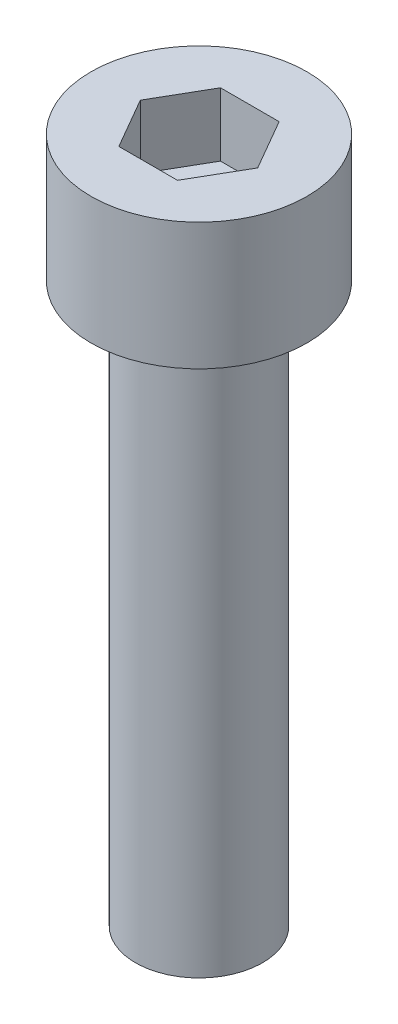
ISO-10303-21;
HEADER;
FILE_DESCRIPTION(('STEP AP214'),'2;1');
FILE_NAME('part.step','',(''),(''),'','','');
FILE_SCHEMA(('AUTOMOTIVE_DESIGN { 1 0 10303 214 1 1 1 1 }'));
ENDSEC;
DATA;
#1=APPLICATION_CONTEXT('core data for automotive mechanical design processes');
#2=APPLICATION_PROTOCOL_DEFINITION('international standard','automotive_design',2000,#1);
#3=PRODUCT_CONTEXT('',#1,'mechanical');
#4=PRODUCT('Part','Part','',(#3));
#5=PRODUCT_RELATED_PRODUCT_CATEGORY('part','',(#4));
#6=PRODUCT_DEFINITION_FORMATION('','',#4);
#7=PRODUCT_DEFINITION_CONTEXT('part definition',#1,'design');
#8=PRODUCT_DEFINITION('design','',#6,#7);
#9=PRODUCT_DEFINITION_SHAPE('','',#8);
#10=(LENGTH_UNIT() NAMED_UNIT(*) SI_UNIT(.MILLI.,.METRE.));
#11=(NAMED_UNIT(*) PLANE_ANGLE_UNIT() SI_UNIT($,.RADIAN.));
#12=(NAMED_UNIT(*) SI_UNIT($,.STERADIAN.) SOLID_ANGLE_UNIT());
#13=UNCERTAINTY_MEASURE_WITH_UNIT(LENGTH_MEASURE(1.E-05),#10,'distance_accuracy_value','');
#14=(GEOMETRIC_REPRESENTATION_CONTEXT(3) GLOBAL_UNCERTAINTY_ASSIGNED_CONTEXT((#13)) GLOBAL_UNIT_ASSIGNED_CONTEXT((#10,
#11,#12)) REPRESENTATION_CONTEXT('',''));
#15=CARTESIAN_POINT('',(0.,0.,0.));
#16=DIRECTION('',(0.,0.,1.));
#17=DIRECTION('',(1.,0.,0.));
#18=AXIS2_PLACEMENT_3D('',#15,#16,#17);
#19=CARTESIAN_POINT('',(0.,5.,0.));
#20=DIRECTION('',(0.,-1.,0.));
#21=DIRECTION('',(0.,0.,-1.));
#22=AXIS2_PLACEMENT_3D('',#19,#20,#21);
#23=CYLINDRICAL_SURFACE('',#22,4.25);
#24=CARTESIAN_POINT('',(0.,5.,0.));
#25=DIRECTION('',(0.,1.,0.));
#26=DIRECTION('',(0.,0.,1.));
#27=AXIS2_PLACEMENT_3D('',#24,#25,#26);
#28=CIRCLE('',#27,4.25);
#29=CARTESIAN_POINT('',(0.,5.,4.25));
#30=VERTEX_POINT('',#29);
#31=EDGE_CURVE('E43',#30,#30,#28,.T.);
#32=ORIENTED_EDGE('',*,*,#31,.F.);
#33=EDGE_LOOP('',(#32));
#34=FACE_BOUND('',#33,.T.);
#35=CARTESIAN_POINT('',(0.,0.,0.));
#36=DIRECTION('',(0.,1.,0.));
#37=DIRECTION('',(0.,0.,1.));
#38=AXIS2_PLACEMENT_3D('',#35,#36,#37);
#39=CIRCLE('',#38,4.25);
#40=CARTESIAN_POINT('',(0.,0.,4.25));
#41=VERTEX_POINT('',#40);
#42=EDGE_CURVE('E38',#41,#41,#39,.T.);
#43=ORIENTED_EDGE('',*,*,#42,.T.);
#44=EDGE_LOOP('',(#43));
#45=FACE_BOUND('',#44,.T.);
#46=ADVANCED_FACE('F35',(#34,#45),#23,.T.);
#47=CARTESIAN_POINT('',(0.,5.,0.));
#48=DIRECTION('',(0.,1.,0.));
#49=DIRECTION('',(0.,0.,1.));
#50=AXIS2_PLACEMENT_3D('',#47,#48,#49);
#51=PLANE('',#50);
#52=DIRECTION('',(0.5,0.,-0.866025403784439));
#53=VECTOR('',#52,1.);
#54=CARTESIAN_POINT('',(1.15470053837925,5.,2.));
#55=LINE('',#54,#53);
#56=CARTESIAN_POINT('',(1.15470053837925,5.,2.));
#57=VERTEX_POINT('',#56);
#58=CARTESIAN_POINT('',(2.3094010767585,5.,0.));
#59=VERTEX_POINT('',#58);
#60=EDGE_CURVE('E51',#57,#59,#55,.T.);
#61=ORIENTED_EDGE('',*,*,#60,.F.);
#62=DIRECTION('',(1.,0.,0.));
#63=VECTOR('',#62,1.);
#64=CARTESIAN_POINT('',(-1.15470053837925,5.,2.));
#65=LINE('',#64,#63);
#66=CARTESIAN_POINT('',(-1.15470053837925,5.,2.));
#67=VERTEX_POINT('',#66);
#68=EDGE_CURVE('E135',#67,#57,#65,.T.);
#69=ORIENTED_EDGE('',*,*,#68,.F.);
#70=DIRECTION('',(0.5,0.,0.866025403784438));
#71=VECTOR('',#70,1.);
#72=CARTESIAN_POINT('',(-2.3094010767585,5.,0.));
#73=LINE('',#72,#71);
#74=CARTESIAN_POINT('',(-2.3094010767585,5.,0.));
#75=VERTEX_POINT('',#74);
#76=EDGE_CURVE('E133',#75,#67,#73,.T.);
#77=ORIENTED_EDGE('',*,*,#76,.F.);
#78=DIRECTION('',(-0.5,0.,0.866025403784439));
#79=VECTOR('',#78,1.);
#80=CARTESIAN_POINT('',(-1.15470053837925,5.,-2.));
#81=LINE('',#80,#79);
#82=CARTESIAN_POINT('',(-1.15470053837925,5.,-2.));
#83=VERTEX_POINT('',#82);
#84=EDGE_CURVE('E99',#83,#75,#81,.T.);
#85=ORIENTED_EDGE('',*,*,#84,.F.);
#86=DIRECTION('',(-1.,0.,0.));
#87=VECTOR('',#86,1.);
#88=CARTESIAN_POINT('',(1.15470053837925,5.,-2.));
#89=LINE('',#88,#87);
#90=CARTESIAN_POINT('',(1.15470053837925,5.,-2.));
#91=VERTEX_POINT('',#90);
#92=EDGE_CURVE('E129',#91,#83,#89,.T.);
#93=ORIENTED_EDGE('',*,*,#92,.F.);
#94=DIRECTION('',(-0.5,0.,-0.866025403784438));
#95=VECTOR('',#94,1.);
#96=CARTESIAN_POINT('',(2.3094010767585,5.,0.));
#97=LINE('',#96,#95);
#98=EDGE_CURVE('E125',#59,#91,#97,.T.);
#99=ORIENTED_EDGE('',*,*,#98,.F.);
#100=EDGE_LOOP('',(#61,#69,#77,#85,#93,#99));
#101=FACE_BOUND('',#100,.T.);
#102=ORIENTED_EDGE('',*,*,#31,.T.);
#103=EDGE_LOOP('',(#102));
#104=FACE_BOUND('',#103,.T.);
#105=ADVANCED_FACE('F153',(#101,#104),#51,.T.);
#106=CARTESIAN_POINT('',(0.,0.,0.));
#107=DIRECTION('',(0.,1.,0.));
#108=DIRECTION('',(0.,0.,1.));
#109=AXIS2_PLACEMENT_3D('',#106,#107,#108);
#110=PLANE('',#109);
#111=CARTESIAN_POINT('',(0.,0.,0.));
#112=DIRECTION('',(0.,-1.,0.));
#113=DIRECTION('',(0.,0.,-1.));
#114=AXIS2_PLACEMENT_3D('',#111,#112,#113);
#115=CIRCLE('',#114,2.5);
#116=CARTESIAN_POINT('',(0.,0.,-2.5));
#117=VERTEX_POINT('',#116);
#118=EDGE_CURVE('E11',#117,#117,#115,.T.);
#119=ORIENTED_EDGE('',*,*,#118,.F.);
#120=EDGE_LOOP('',(#119));
#121=FACE_BOUND('',#120,.T.);
#122=ORIENTED_EDGE('',*,*,#42,.F.);
#123=EDGE_LOOP('',(#122));
#124=FACE_BOUND('',#123,.T.);
#125=ADVANCED_FACE('F150',(#121,#124),#110,.F.);
#126=CARTESIAN_POINT('',(1.15470053837925,2.5,2.));
#127=DIRECTION('',(0.866025403784439,0.,0.5));
#128=DIRECTION('',(0.5,0.,-0.866025403784439));
#129=AXIS2_PLACEMENT_3D('',#126,#127,#128);
#130=PLANE('',#129);
#131=ORIENTED_EDGE('',*,*,#60,.T.);
#132=DIRECTION('',(0.,1.,0.));
#133=VECTOR('',#132,1.);
#134=CARTESIAN_POINT('',(2.3094010767585,2.5,0.));
#135=LINE('',#134,#133);
#136=CARTESIAN_POINT('',(2.3094010767585,2.5,0.));
#137=VERTEX_POINT('',#136);
#138=EDGE_CURVE('E81',#137,#59,#135,.T.);
#139=ORIENTED_EDGE('',*,*,#138,.F.);
#140=DIRECTION('',(0.5,0.,-0.866025403784439));
#141=VECTOR('',#140,1.);
#142=CARTESIAN_POINT('',(1.15470053837925,2.5,2.));
#143=LINE('',#142,#141);
#144=CARTESIAN_POINT('',(1.15470053837925,2.5,2.));
#145=VERTEX_POINT('',#144);
#146=EDGE_CURVE('E137',#145,#137,#143,.T.);
#147=ORIENTED_EDGE('',*,*,#146,.F.);
#148=DIRECTION('',(0.,1.,0.));
#149=VECTOR('',#148,1.);
#150=CARTESIAN_POINT('',(1.15470053837925,2.5,2.));
#151=LINE('',#150,#149);
#152=EDGE_CURVE('E59',#145,#57,#151,.T.);
#153=ORIENTED_EDGE('',*,*,#152,.T.);
#154=EDGE_LOOP('',(#131,#139,#147,#153));
#155=FACE_BOUND('',#154,.T.);
#156=ADVANCED_FACE('F152',(#155),#130,.F.);
#157=CARTESIAN_POINT('',(-1.15470053837925,2.5,2.));
#158=DIRECTION('',(0.,0.,1.));
#159=DIRECTION('',(1.,0.,0.));
#160=AXIS2_PLACEMENT_3D('',#157,#158,#159);
#161=PLANE('',#160);
#162=ORIENTED_EDGE('',*,*,#68,.T.);
#163=ORIENTED_EDGE('',*,*,#152,.F.);
#164=DIRECTION('',(1.,0.,0.));
#165=VECTOR('',#164,1.);
#166=CARTESIAN_POINT('',(-1.15470053837925,2.5,2.));
#167=LINE('',#166,#165);
#168=CARTESIAN_POINT('',(-1.15470053837925,2.5,2.));
#169=VERTEX_POINT('',#168);
#170=EDGE_CURVE('E111',#169,#145,#167,.T.);
#171=ORIENTED_EDGE('',*,*,#170,.F.);
#172=DIRECTION('',(0.,1.,0.));
#173=VECTOR('',#172,1.);
#174=CARTESIAN_POINT('',(-1.15470053837925,2.5,2.));
#175=LINE('',#174,#173);
#176=EDGE_CURVE('E103',#169,#67,#175,.T.);
#177=ORIENTED_EDGE('',*,*,#176,.T.);
#178=EDGE_LOOP('',(#162,#163,#171,#177));
#179=FACE_BOUND('',#178,.T.);
#180=ADVANCED_FACE('F159',(#179),#161,.F.);
#181=CARTESIAN_POINT('',(-2.3094010767585,2.5,0.));
#182=DIRECTION('',(-0.866025403784439,0.,0.5));
#183=DIRECTION('',(0.5,0.,0.866025403784439));
#184=AXIS2_PLACEMENT_3D('',#181,#182,#183);
#185=PLANE('',#184);
#186=ORIENTED_EDGE('',*,*,#76,.T.);
#187=ORIENTED_EDGE('',*,*,#176,.F.);
#188=DIRECTION('',(0.5,0.,0.866025403784438));
#189=VECTOR('',#188,1.);
#190=CARTESIAN_POINT('',(-2.3094010767585,2.5,0.));
#191=LINE('',#190,#189);
#192=CARTESIAN_POINT('',(-2.3094010767585,2.5,0.));
#193=VERTEX_POINT('',#192);
#194=EDGE_CURVE('E107',#193,#169,#191,.T.);
#195=ORIENTED_EDGE('',*,*,#194,.F.);
#196=DIRECTION('',(0.,1.,0.));
#197=VECTOR('',#196,1.);
#198=CARTESIAN_POINT('',(-2.3094010767585,2.5,0.));
#199=LINE('',#198,#197);
#200=EDGE_CURVE('E92',#193,#75,#199,.T.);
#201=ORIENTED_EDGE('',*,*,#200,.T.);
#202=EDGE_LOOP('',(#186,#187,#195,#201));
#203=FACE_BOUND('',#202,.T.);
#204=ADVANCED_FACE('F108',(#203),#185,.F.);
#205=CARTESIAN_POINT('',(-1.15470053837925,2.5,-2.));
#206=DIRECTION('',(-0.866025403784439,0.,-0.5));
#207=DIRECTION('',(-0.5,0.,0.866025403784439));
#208=AXIS2_PLACEMENT_3D('',#205,#206,#207);
#209=PLANE('',#208);
#210=ORIENTED_EDGE('',*,*,#84,.T.);
#211=ORIENTED_EDGE('',*,*,#200,.F.);
#212=DIRECTION('',(-0.5,0.,0.866025403784439));
#213=VECTOR('',#212,1.);
#214=CARTESIAN_POINT('',(-1.15470053837925,2.5,-2.));
#215=LINE('',#214,#213);
#216=CARTESIAN_POINT('',(-1.15470053837925,2.5,-2.));
#217=VERTEX_POINT('',#216);
#218=EDGE_CURVE('E96',#217,#193,#215,.T.);
#219=ORIENTED_EDGE('',*,*,#218,.F.);
#220=DIRECTION('',(0.,1.,0.));
#221=VECTOR('',#220,1.);
#222=CARTESIAN_POINT('',(-1.15470053837925,2.5,-2.));
#223=LINE('',#222,#221);
#224=EDGE_CURVE('E104',#217,#83,#223,.T.);
#225=ORIENTED_EDGE('',*,*,#224,.T.);
#226=EDGE_LOOP('',(#210,#211,#219,#225));
#227=FACE_BOUND('',#226,.T.);
#228=ADVANCED_FACE('F94',(#227),#209,.F.);
#229=CARTESIAN_POINT('',(1.15470053837925,2.5,-2.));
#230=DIRECTION('',(0.,0.,-1.));
#231=DIRECTION('',(-1.,0.,0.));
#232=AXIS2_PLACEMENT_3D('',#229,#230,#231);
#233=PLANE('',#232);
#234=ORIENTED_EDGE('',*,*,#92,.T.);
#235=ORIENTED_EDGE('',*,*,#224,.F.);
#236=DIRECTION('',(-1.,0.,0.));
#237=VECTOR('',#236,1.);
#238=CARTESIAN_POINT('',(1.15470053837925,2.5,-2.));
#239=LINE('',#238,#237);
#240=CARTESIAN_POINT('',(1.15470053837925,2.5,-2.));
#241=VERTEX_POINT('',#240);
#242=EDGE_CURVE('E117',#241,#217,#239,.T.);
#243=ORIENTED_EDGE('',*,*,#242,.F.);
#244=DIRECTION('',(0.,1.,0.));
#245=VECTOR('',#244,1.);
#246=CARTESIAN_POINT('',(1.15470053837925,2.5,-2.));
#247=LINE('',#246,#245);
#248=EDGE_CURVE('E141',#241,#91,#247,.T.);
#249=ORIENTED_EDGE('',*,*,#248,.T.);
#250=EDGE_LOOP('',(#234,#235,#243,#249));
#251=FACE_BOUND('',#250,.T.);
#252=ADVANCED_FACE('F204',(#251),#233,.F.);
#253=CARTESIAN_POINT('',(2.3094010767585,2.5,0.));
#254=DIRECTION('',(0.866025403784438,0.,-0.5));
#255=DIRECTION('',(-0.5,0.,-0.866025403784439));
#256=AXIS2_PLACEMENT_3D('',#253,#254,#255);
#257=PLANE('',#256);
#258=ORIENTED_EDGE('',*,*,#98,.T.);
#259=ORIENTED_EDGE('',*,*,#248,.F.);
#260=DIRECTION('',(-0.5,0.,-0.866025403784438));
#261=VECTOR('',#260,1.);
#262=CARTESIAN_POINT('',(2.3094010767585,2.5,0.));
#263=LINE('',#262,#261);
#264=EDGE_CURVE('E119',#137,#241,#263,.T.);
#265=ORIENTED_EDGE('',*,*,#264,.F.);
#266=ORIENTED_EDGE('',*,*,#138,.T.);
#267=EDGE_LOOP('',(#258,#259,#265,#266));
#268=FACE_BOUND('',#267,.T.);
#269=ADVANCED_FACE('F213',(#268),#257,.F.);
#270=CARTESIAN_POINT('',(0.,2.5,0.));
#271=DIRECTION('',(0.,1.,0.));
#272=DIRECTION('',(0.,0.,1.));
#273=AXIS2_PLACEMENT_3D('',#270,#271,#272);
#274=PLANE('',#273);
#275=ORIENTED_EDGE('',*,*,#146,.T.);
#276=ORIENTED_EDGE('',*,*,#264,.T.);
#277=ORIENTED_EDGE('',*,*,#242,.T.);
#278=ORIENTED_EDGE('',*,*,#218,.T.);
#279=ORIENTED_EDGE('',*,*,#194,.T.);
#280=ORIENTED_EDGE('',*,*,#170,.T.);
#281=EDGE_LOOP('',(#275,#276,#277,#278,#279,#280));
#282=FACE_BOUND('',#281,.T.);
#283=ADVANCED_FACE('F114',(#282),#274,.T.);
#284=CARTESIAN_POINT('',(0.,-22.,0.));
#285=DIRECTION('',(0.,1.,0.));
#286=DIRECTION('',(0.,0.,1.));
#287=AXIS2_PLACEMENT_3D('',#284,#285,#286);
#288=CYLINDRICAL_SURFACE('',#287,2.5);
#289=CARTESIAN_POINT('',(0.,-22.,0.));
#290=DIRECTION('',(0.,-1.,0.));
#291=DIRECTION('',(0.,0.,-1.));
#292=AXIS2_PLACEMENT_3D('',#289,#290,#291);
#293=CIRCLE('',#292,2.5);
#294=CARTESIAN_POINT('',(0.,-22.,-2.5));
#295=VERTEX_POINT('',#294);
#296=EDGE_CURVE('E126',#295,#295,#293,.T.);
#297=ORIENTED_EDGE('',*,*,#296,.F.);
#298=EDGE_LOOP('',(#297));
#299=FACE_BOUND('',#298,.T.);
#300=ORIENTED_EDGE('',*,*,#118,.T.);
#301=EDGE_LOOP('',(#300));
#302=FACE_BOUND('',#301,.T.);
#303=ADVANCED_FACE('F231',(#299,#302),#288,.T.);
#304=CARTESIAN_POINT('',(0.,-22.,0.));
#305=DIRECTION('',(0.,-1.,0.));
#306=DIRECTION('',(0.,0.,-1.));
#307=AXIS2_PLACEMENT_3D('',#304,#305,#306);
#308=PLANE('',#307);
#309=ORIENTED_EDGE('',*,*,#296,.T.);
#310=EDGE_LOOP('',(#309));
#311=FACE_BOUND('',#310,.T.);
#312=ADVANCED_FACE('F244',(#311),#308,.T.);
#313=CLOSED_SHELL('',(#46,#105,#125,#156,#180,#204,#228,#252,#269,#283,#303,#312));
#314=MANIFOLD_SOLID_BREP('B2',#313);
#315=ADVANCED_BREP_SHAPE_REPRESENTATION('',(#18,#314),#14);
#316=SHAPE_DEFINITION_REPRESENTATION(#9,#315);
ENDSEC;
END-ISO-10303-21;
